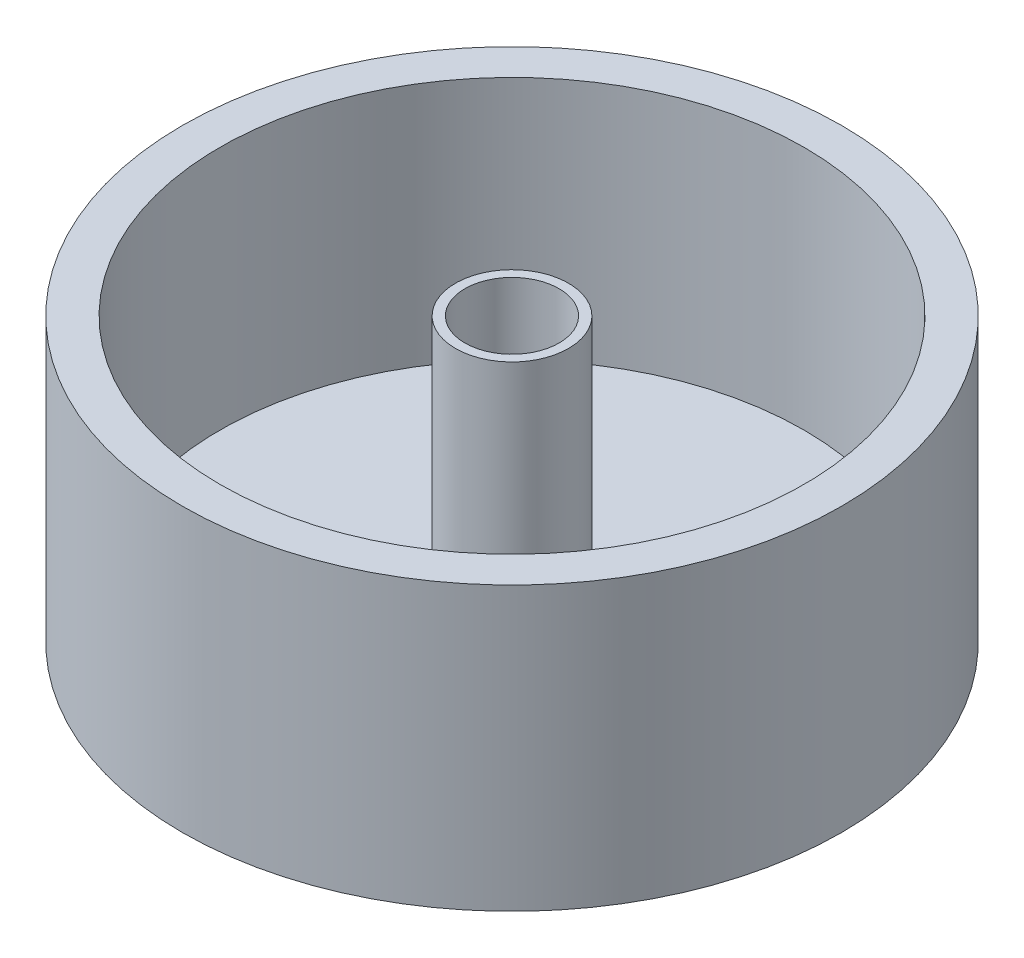
ISO-10303-21;
HEADER;
FILE_DESCRIPTION(('STEP AP214'),'2;1');
FILE_NAME('part.step','',(''),(''),'','','');
FILE_SCHEMA(('AUTOMOTIVE_DESIGN { 1 0 10303 214 1 1 1 1 }'));
ENDSEC;
DATA;
#1=APPLICATION_CONTEXT('core data for automotive mechanical design processes');
#2=APPLICATION_PROTOCOL_DEFINITION('international standard','automotive_design',2000,#1);
#3=PRODUCT_CONTEXT('',#1,'mechanical');
#4=PRODUCT('Part','Part','',(#3));
#5=PRODUCT_RELATED_PRODUCT_CATEGORY('part','',(#4));
#6=PRODUCT_DEFINITION_FORMATION('','',#4);
#7=PRODUCT_DEFINITION_CONTEXT('part definition',#1,'design');
#8=PRODUCT_DEFINITION('design','',#6,#7);
#9=PRODUCT_DEFINITION_SHAPE('','',#8);
#10=(LENGTH_UNIT() NAMED_UNIT(*) SI_UNIT(.MILLI.,.METRE.));
#11=(NAMED_UNIT(*) PLANE_ANGLE_UNIT() SI_UNIT($,.RADIAN.));
#12=(NAMED_UNIT(*) SI_UNIT($,.STERADIAN.) SOLID_ANGLE_UNIT());
#13=UNCERTAINTY_MEASURE_WITH_UNIT(LENGTH_MEASURE(1.E-05),#10,'distance_accuracy_value','');
#14=(GEOMETRIC_REPRESENTATION_CONTEXT(3) GLOBAL_UNCERTAINTY_ASSIGNED_CONTEXT((#13)) GLOBAL_UNIT_ASSIGNED_CONTEXT((#10,
#11,#12)) REPRESENTATION_CONTEXT('',''));
#15=CARTESIAN_POINT('',(0.,0.,0.));
#16=DIRECTION('',(0.,0.,1.));
#17=DIRECTION('',(1.,0.,0.));
#18=AXIS2_PLACEMENT_3D('',#15,#16,#17);
#19=CARTESIAN_POINT('',(0.,20.,0.));
#20=DIRECTION('',(0.,1.,0.));
#21=DIRECTION('',(0.,0.,1.));
#22=AXIS2_PLACEMENT_3D('',#19,#20,#21);
#23=PLANE('',#22);
#24=CARTESIAN_POINT('',(0.,20.,0.));
#25=DIRECTION('',(0.,1.,0.));
#26=DIRECTION('',(0.,0.,1.));
#27=AXIS2_PLACEMENT_3D('',#24,#25,#26);
#28=CIRCLE('',#27,155.);
#29=CARTESIAN_POINT('',(0.,20.,155.));
#30=VERTEX_POINT('',#29);
#31=EDGE_CURVE('E10',#30,#30,#28,.F.);
#32=ORIENTED_EDGE('',*,*,#31,.F.);
#33=EDGE_LOOP('',(#32));
#34=FACE_BOUND('',#33,.T.);
#35=CARTESIAN_POINT('',(0.,20.,0.));
#36=DIRECTION('',(0.,1.,0.));
#37=DIRECTION('',(0.,0.,1.));
#38=AXIS2_PLACEMENT_3D('',#35,#36,#37);
#39=CIRCLE('',#38,30.);
#40=CARTESIAN_POINT('',(0.,20.,30.));
#41=VERTEX_POINT('',#40);
#42=EDGE_CURVE('E59',#41,#41,#39,.T.);
#43=ORIENTED_EDGE('',*,*,#42,.F.);
#44=EDGE_LOOP('',(#43));
#45=FACE_BOUND('',#44,.T.);
#46=ADVANCED_FACE('F35',(#34,#45),#23,.T.);
#47=CARTESIAN_POINT('',(0.,20.,0.));
#48=DIRECTION('',(0.,-1.,0.));
#49=DIRECTION('',(0.,0.,-1.));
#50=AXIS2_PLACEMENT_3D('',#47,#48,#49);
#51=CYLINDRICAL_SURFACE('',#50,175.);
#52=CARTESIAN_POINT('',(0.,0.,0.));
#53=DIRECTION('',(0.,1.,0.));
#54=DIRECTION('',(0.,0.,1.));
#55=AXIS2_PLACEMENT_3D('',#52,#53,#54);
#56=CIRCLE('',#55,175.);
#57=CARTESIAN_POINT('',(0.,0.,175.));
#58=VERTEX_POINT('',#57);
#59=EDGE_CURVE('E42',#58,#58,#56,.T.);
#60=ORIENTED_EDGE('',*,*,#59,.T.);
#61=EDGE_LOOP('',(#60));
#62=FACE_BOUND('',#61,.T.);
#63=CARTESIAN_POINT('',(0.,150.,0.));
#64=DIRECTION('',(0.,1.,0.));
#65=DIRECTION('',(0.,0.,1.));
#66=AXIS2_PLACEMENT_3D('',#63,#64,#65);
#67=CIRCLE('',#66,175.);
#68=CARTESIAN_POINT('',(0.,150.,175.));
#69=VERTEX_POINT('',#68);
#70=EDGE_CURVE('E46',#69,#69,#67,.T.);
#71=ORIENTED_EDGE('',*,*,#70,.F.);
#72=EDGE_LOOP('',(#71));
#73=FACE_BOUND('',#72,.T.);
#74=ADVANCED_FACE('F37',(#62,#73),#51,.T.);
#75=CARTESIAN_POINT('',(0.,0.,0.));
#76=DIRECTION('',(0.,1.,0.));
#77=DIRECTION('',(0.,0.,1.));
#78=AXIS2_PLACEMENT_3D('',#75,#76,#77);
#79=PLANE('',#78);
#80=CARTESIAN_POINT('',(0.,0.,0.));
#81=DIRECTION('',(0.,1.,0.));
#82=DIRECTION('',(0.,0.,1.));
#83=AXIS2_PLACEMENT_3D('',#80,#81,#82);
#84=CIRCLE('',#83,25.);
#85=CARTESIAN_POINT('',(0.,0.,25.));
#86=VERTEX_POINT('',#85);
#87=EDGE_CURVE('E55',#86,#86,#84,.T.);
#88=ORIENTED_EDGE('',*,*,#87,.T.);
#89=EDGE_LOOP('',(#88));
#90=FACE_BOUND('',#89,.T.);
#91=ORIENTED_EDGE('',*,*,#59,.F.);
#92=EDGE_LOOP('',(#91));
#93=FACE_BOUND('',#92,.T.);
#94=ADVANCED_FACE('F90',(#90,#93),#79,.F.);
#95=CARTESIAN_POINT('',(0.,150.,0.));
#96=DIRECTION('',(0.,1.,0.));
#97=DIRECTION('',(0.,0.,1.));
#98=AXIS2_PLACEMENT_3D('',#95,#96,#97);
#99=PLANE('',#98);
#100=ORIENTED_EDGE('',*,*,#70,.T.);
#101=EDGE_LOOP('',(#100));
#102=FACE_BOUND('',#101,.T.);
#103=CARTESIAN_POINT('',(0.,150.,0.));
#104=DIRECTION('',(0.,1.,0.));
#105=DIRECTION('',(0.,0.,1.));
#106=AXIS2_PLACEMENT_3D('',#103,#104,#105);
#107=CIRCLE('',#106,155.);
#108=CARTESIAN_POINT('',(0.,150.,155.));
#109=VERTEX_POINT('',#108);
#110=EDGE_CURVE('E50',#109,#109,#107,.T.);
#111=ORIENTED_EDGE('',*,*,#110,.F.);
#112=EDGE_LOOP('',(#111));
#113=FACE_BOUND('',#112,.T.);
#114=ADVANCED_FACE('F93',(#102,#113),#99,.T.);
#115=CARTESIAN_POINT('',(0.,150.,0.));
#116=DIRECTION('',(0.,-1.,0.));
#117=DIRECTION('',(0.,0.,-1.));
#118=AXIS2_PLACEMENT_3D('',#115,#116,#117);
#119=CYLINDRICAL_SURFACE('',#118,155.);
#120=ORIENTED_EDGE('',*,*,#110,.T.);
#121=EDGE_LOOP('',(#120));
#122=FACE_BOUND('',#121,.T.);
#123=ORIENTED_EDGE('',*,*,#31,.T.);
#124=EDGE_LOOP('',(#123));
#125=FACE_BOUND('',#124,.T.);
#126=ADVANCED_FACE('F81',(#122,#125),#119,.F.);
#127=CARTESIAN_POINT('',(0.,0.,0.));
#128=DIRECTION('',(0.,1.,0.));
#129=DIRECTION('',(0.,0.,1.));
#130=AXIS2_PLACEMENT_3D('',#127,#128,#129);
#131=CYLINDRICAL_SURFACE('',#130,25.);
#132=ORIENTED_EDGE('',*,*,#87,.F.);
#133=EDGE_LOOP('',(#132));
#134=FACE_BOUND('',#133,.T.);
#135=CARTESIAN_POINT('',(0.,150.,0.));
#136=DIRECTION('',(0.,1.,0.));
#137=DIRECTION('',(0.,0.,1.));
#138=AXIS2_PLACEMENT_3D('',#135,#136,#137);
#139=CIRCLE('',#138,25.);
#140=CARTESIAN_POINT('',(0.,150.,25.));
#141=VERTEX_POINT('',#140);
#142=EDGE_CURVE('E62',#141,#141,#139,.T.);
#143=ORIENTED_EDGE('',*,*,#142,.T.);
#144=EDGE_LOOP('',(#143));
#145=FACE_BOUND('',#144,.T.);
#146=ADVANCED_FACE('F68',(#134,#145),#131,.F.);
#147=CARTESIAN_POINT('',(0.,150.,0.));
#148=DIRECTION('',(0.,1.,0.));
#149=DIRECTION('',(0.,0.,1.));
#150=AXIS2_PLACEMENT_3D('',#147,#148,#149);
#151=PLANE('',#150);
#152=CARTESIAN_POINT('',(0.,150.,0.));
#153=DIRECTION('',(0.,1.,0.));
#154=DIRECTION('',(0.,0.,1.));
#155=AXIS2_PLACEMENT_3D('',#152,#153,#154);
#156=CIRCLE('',#155,30.);
#157=CARTESIAN_POINT('',(0.,150.,30.));
#158=VERTEX_POINT('',#157);
#159=EDGE_CURVE('E58',#158,#158,#156,.T.);
#160=ORIENTED_EDGE('',*,*,#159,.T.);
#161=EDGE_LOOP('',(#160));
#162=FACE_BOUND('',#161,.T.);
#163=ORIENTED_EDGE('',*,*,#142,.F.);
#164=EDGE_LOOP('',(#163));
#165=FACE_BOUND('',#164,.T.);
#166=ADVANCED_FACE('F70',(#162,#165),#151,.T.);
#167=CARTESIAN_POINT('',(0.,150.,0.));
#168=DIRECTION('',(0.,-1.,0.));
#169=DIRECTION('',(0.,0.,-1.));
#170=AXIS2_PLACEMENT_3D('',#167,#168,#169);
#171=CYLINDRICAL_SURFACE('',#170,30.);
#172=ORIENTED_EDGE('',*,*,#159,.F.);
#173=EDGE_LOOP('',(#172));
#174=FACE_BOUND('',#173,.T.);
#175=ORIENTED_EDGE('',*,*,#42,.T.);
#176=EDGE_LOOP('',(#175));
#177=FACE_BOUND('',#176,.T.);
#178=ADVANCED_FACE('F72',(#174,#177),#171,.T.);
#179=CLOSED_SHELL('',(#46,#74,#94,#114,#126,#146,#166,#178));
#180=MANIFOLD_SOLID_BREP('B2',#179);
#181=ADVANCED_BREP_SHAPE_REPRESENTATION('',(#18,#180),#14);
#182=SHAPE_DEFINITION_REPRESENTATION(#9,#181);
ENDSEC;
END-ISO-10303-21;
